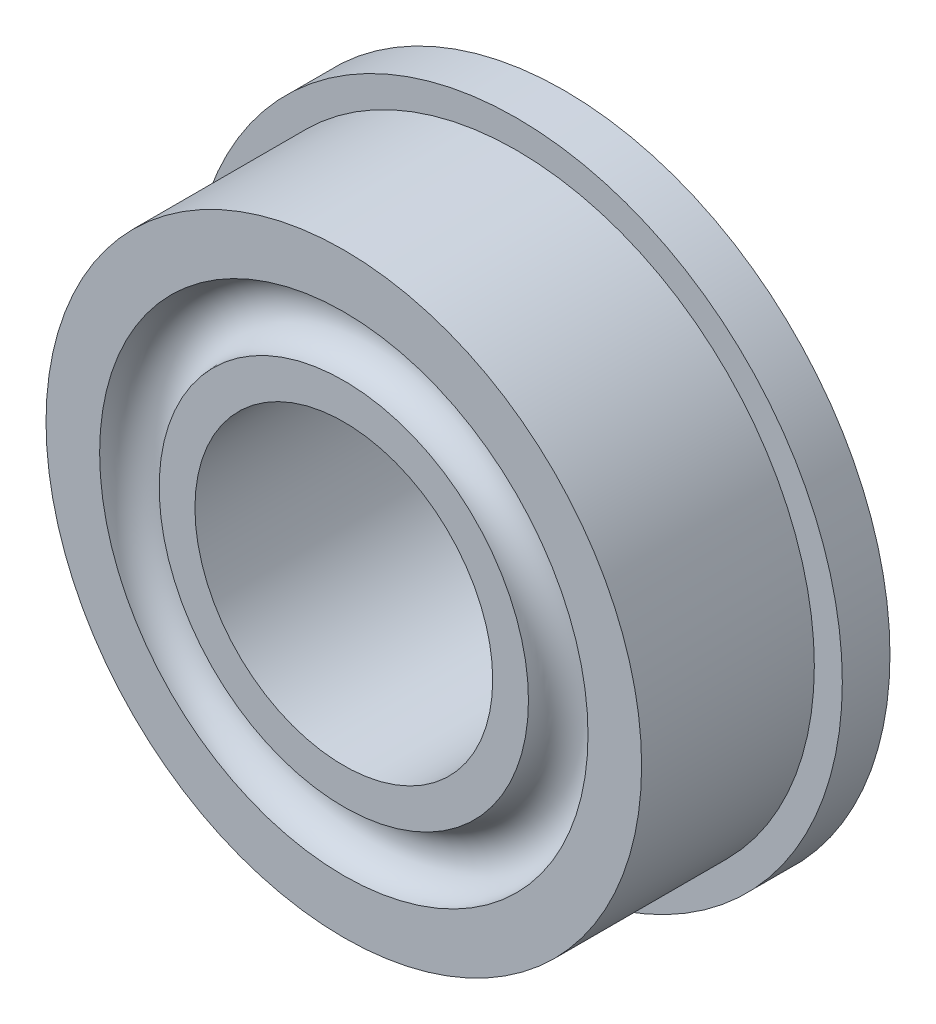
ISO-10303-21;
HEADER;
FILE_DESCRIPTION(('STEP AP214'),'2;1');
FILE_NAME('part.step','',(''),(''),'','','');
FILE_SCHEMA(('AUTOMOTIVE_DESIGN { 1 0 10303 214 1 1 1 1 }'));
ENDSEC;
DATA;
#1=APPLICATION_CONTEXT('core data for automotive mechanical design processes');
#2=APPLICATION_PROTOCOL_DEFINITION('international standard','automotive_design',2000,#1);
#3=PRODUCT_CONTEXT('',#1,'mechanical');
#4=PRODUCT('Part','Part','',(#3));
#5=PRODUCT_RELATED_PRODUCT_CATEGORY('part','',(#4));
#6=PRODUCT_DEFINITION_FORMATION('','',#4);
#7=PRODUCT_DEFINITION_CONTEXT('part definition',#1,'design');
#8=PRODUCT_DEFINITION('design','',#6,#7);
#9=PRODUCT_DEFINITION_SHAPE('','',#8);
#10=(LENGTH_UNIT() NAMED_UNIT(*) SI_UNIT(.MILLI.,.METRE.));
#11=(NAMED_UNIT(*) PLANE_ANGLE_UNIT() SI_UNIT($,.RADIAN.));
#12=(NAMED_UNIT(*) SI_UNIT($,.STERADIAN.) SOLID_ANGLE_UNIT());
#13=UNCERTAINTY_MEASURE_WITH_UNIT(LENGTH_MEASURE(1.E-05),#10,'distance_accuracy_value','');
#14=(GEOMETRIC_REPRESENTATION_CONTEXT(3) GLOBAL_UNCERTAINTY_ASSIGNED_CONTEXT((#13)) GLOBAL_UNIT_ASSIGNED_CONTEXT((#10,
#11,#12)) REPRESENTATION_CONTEXT('',''));
#15=CARTESIAN_POINT('',(0.,0.,0.));
#16=DIRECTION('',(0.,0.,1.));
#17=DIRECTION('',(1.,0.,0.));
#18=AXIS2_PLACEMENT_3D('',#15,#16,#17);
#19=CARTESIAN_POINT('',(0.,0.,0.));
#20=DIRECTION('',(0.,0.,1.));
#21=DIRECTION('',(1.,0.,0.));
#22=AXIS2_PLACEMENT_3D('',#19,#20,#21);
#23=PLANE('',#22);
#24=CARTESIAN_POINT('',(0.,0.,0.));
#25=DIRECTION('',(0.,0.,1.));
#26=DIRECTION('',(1.,0.,0.));
#27=AXIS2_PLACEMENT_3D('',#24,#25,#26);
#28=CIRCLE('',#27,6.9469);
#29=CARTESIAN_POINT('',(6.9469,0.,0.));
#30=VERTEX_POINT('',#29);
#31=EDGE_CURVE('E36',#30,#30,#28,.T.);
#32=ORIENTED_EDGE('',*,*,#31,.F.);
#33=EDGE_LOOP('',(#32));
#34=FACE_BOUND('',#33,.T.);
#35=CARTESIAN_POINT('',(0.,0.,0.));
#36=DIRECTION('',(0.,0.,1.));
#37=DIRECTION('',(1.,0.,0.));
#38=AXIS2_PLACEMENT_3D('',#35,#36,#37);
#39=CIRCLE('',#38,5.207);
#40=CARTESIAN_POINT('',(5.207,0.,0.));
#41=VERTEX_POINT('',#40);
#42=EDGE_CURVE('E69',#41,#41,#39,.T.);
#43=ORIENTED_EDGE('',*,*,#42,.T.);
#44=EDGE_LOOP('',(#43));
#45=FACE_BOUND('',#44,.T.);
#46=ADVANCED_FACE('F32',(#34,#45),#23,.F.);
#47=CARTESIAN_POINT('',(0.,0.,0.));
#48=DIRECTION('',(0.,0.,1.));
#49=DIRECTION('',(1.,0.,0.));
#50=AXIS2_PLACEMENT_3D('',#47,#48,#49);
#51=CIRCLE('',#50,3.175);
#52=CARTESIAN_POINT('',(3.175,0.,0.));
#53=VERTEX_POINT('',#52);
#54=EDGE_CURVE('E43',#53,#53,#51,.T.);
#55=ORIENTED_EDGE('',*,*,#54,.T.);
#56=EDGE_LOOP('',(#55));
#57=FACE_BOUND('',#56,.T.);
#58=CARTESIAN_POINT('',(0.,0.,0.));
#59=DIRECTION('',(0.,0.,1.));
#60=DIRECTION('',(1.,0.,0.));
#61=AXIS2_PLACEMENT_3D('',#58,#59,#60);
#62=CIRCLE('',#61,3.937);
#63=CARTESIAN_POINT('',(3.937,0.,0.));
#64=VERTEX_POINT('',#63);
#65=EDGE_CURVE('E65',#64,#64,#62,.T.);
#66=ORIENTED_EDGE('',*,*,#65,.F.);
#67=EDGE_LOOP('',(#66));
#68=FACE_BOUND('',#67,.T.);
#69=ADVANCED_FACE('F86',(#57,#68),#23,.F.);
#70=CARTESIAN_POINT('',(0.,0.,4.699));
#71=DIRECTION('',(0.,0.,1.));
#72=DIRECTION('',(1.,0.,0.));
#73=AXIS2_PLACEMENT_3D('',#70,#71,#72);
#74=PLANE('',#73);
#75=CARTESIAN_POINT('',(0.,0.,4.699));
#76=DIRECTION('',(0.,0.,1.));
#77=DIRECTION('',(1.,0.,0.));
#78=AXIS2_PLACEMENT_3D('',#75,#76,#77);
#79=CIRCLE('',#78,6.35);
#80=CARTESIAN_POINT('',(6.35,0.,4.699));
#81=VERTEX_POINT('',#80);
#82=EDGE_CURVE('E48',#81,#81,#79,.T.);
#83=ORIENTED_EDGE('',*,*,#82,.T.);
#84=EDGE_LOOP('',(#83));
#85=FACE_BOUND('',#84,.T.);
#86=CARTESIAN_POINT('',(0.,0.,4.699));
#87=DIRECTION('',(0.,0.,1.));
#88=DIRECTION('',(1.,0.,0.));
#89=AXIS2_PLACEMENT_3D('',#86,#87,#88);
#90=CIRCLE('',#89,5.207);
#91=CARTESIAN_POINT('',(5.207,0.,4.699));
#92=VERTEX_POINT('',#91);
#93=EDGE_CURVE('E62',#92,#92,#90,.T.);
#94=ORIENTED_EDGE('',*,*,#93,.F.);
#95=EDGE_LOOP('',(#94));
#96=FACE_BOUND('',#95,.T.);
#97=ADVANCED_FACE('F91',(#85,#96),#74,.T.);
#98=CARTESIAN_POINT('',(0.,0.,4.699));
#99=DIRECTION('',(0.,0.,1.));
#100=DIRECTION('',(1.,0.,0.));
#101=AXIS2_PLACEMENT_3D('',#98,#99,#100);
#102=CIRCLE('',#101,3.175);
#103=CARTESIAN_POINT('',(3.175,0.,4.699));
#104=VERTEX_POINT('',#103);
#105=EDGE_CURVE('E52',#104,#104,#102,.T.);
#106=ORIENTED_EDGE('',*,*,#105,.F.);
#107=EDGE_LOOP('',(#106));
#108=FACE_BOUND('',#107,.T.);
#109=CARTESIAN_POINT('',(0.,0.,4.699));
#110=DIRECTION('',(0.,0.,1.));
#111=DIRECTION('',(1.,0.,0.));
#112=AXIS2_PLACEMENT_3D('',#109,#110,#111);
#113=CIRCLE('',#112,3.937);
#114=CARTESIAN_POINT('',(3.937,0.,4.699));
#115=VERTEX_POINT('',#114);
#116=EDGE_CURVE('E58',#115,#115,#113,.T.);
#117=ORIENTED_EDGE('',*,*,#116,.T.);
#118=EDGE_LOOP('',(#117));
#119=FACE_BOUND('',#118,.T.);
#120=ADVANCED_FACE('F98',(#108,#119),#74,.T.);
#121=CARTESIAN_POINT('',(0.,0.,1.016));
#122=DIRECTION('',(0.,0.,1.));
#123=DIRECTION('',(1.,0.,0.));
#124=AXIS2_PLACEMENT_3D('',#121,#122,#123);
#125=PLANE('',#124);
#126=CARTESIAN_POINT('',(0.,0.,1.016));
#127=DIRECTION('',(0.,0.,1.));
#128=DIRECTION('',(1.,0.,0.));
#129=AXIS2_PLACEMENT_3D('',#126,#127,#128);
#130=CIRCLE('',#129,6.9469);
#131=CARTESIAN_POINT('',(6.9469,0.,1.016));
#132=VERTEX_POINT('',#131);
#133=EDGE_CURVE('E10',#132,#132,#130,.T.);
#134=ORIENTED_EDGE('',*,*,#133,.T.);
#135=EDGE_LOOP('',(#134));
#136=FACE_BOUND('',#135,.T.);
#137=CARTESIAN_POINT('',(0.,0.,1.016));
#138=DIRECTION('',(0.,0.,1.));
#139=DIRECTION('',(1.,0.,0.));
#140=AXIS2_PLACEMENT_3D('',#137,#138,#139);
#141=CIRCLE('',#140,6.35);
#142=CARTESIAN_POINT('',(6.35,0.,1.016));
#143=VERTEX_POINT('',#142);
#144=EDGE_CURVE('E49',#143,#143,#141,.T.);
#145=ORIENTED_EDGE('',*,*,#144,.F.);
#146=EDGE_LOOP('',(#145));
#147=FACE_BOUND('',#146,.T.);
#148=ADVANCED_FACE('F95',(#136,#147),#125,.T.);
#149=CARTESIAN_POINT('',(0.,0.,1.016));
#150=DIRECTION('',(0.,0.,-1.));
#151=DIRECTION('',(-1.,0.,0.));
#152=AXIS2_PLACEMENT_3D('',#149,#150,#151);
#153=CYLINDRICAL_SURFACE('',#152,6.9469);
#154=ORIENTED_EDGE('',*,*,#133,.F.);
#155=EDGE_LOOP('',(#154));
#156=FACE_BOUND('',#155,.T.);
#157=ORIENTED_EDGE('',*,*,#31,.T.);
#158=EDGE_LOOP('',(#157));
#159=FACE_BOUND('',#158,.T.);
#160=ADVANCED_FACE('F34',(#156,#159),#153,.T.);
#161=CARTESIAN_POINT('',(0.,0.,1.016));
#162=DIRECTION('',(0.,0.,-1.));
#163=DIRECTION('',(-1.,0.,0.));
#164=AXIS2_PLACEMENT_3D('',#161,#162,#163);
#165=CYLINDRICAL_SURFACE('',#164,3.175);
#166=ORIENTED_EDGE('',*,*,#54,.F.);
#167=EDGE_LOOP('',(#166));
#168=FACE_BOUND('',#167,.T.);
#169=ORIENTED_EDGE('',*,*,#105,.T.);
#170=EDGE_LOOP('',(#169));
#171=FACE_BOUND('',#170,.T.);
#172=ADVANCED_FACE('F99',(#168,#171),#165,.F.);
#173=CARTESIAN_POINT('',(0.,0.,4.699));
#174=DIRECTION('',(0.,0.,-1.));
#175=DIRECTION('',(-1.,0.,0.));
#176=AXIS2_PLACEMENT_3D('',#173,#174,#175);
#177=CYLINDRICAL_SURFACE('',#176,6.35);
#178=ORIENTED_EDGE('',*,*,#82,.F.);
#179=EDGE_LOOP('',(#178));
#180=FACE_BOUND('',#179,.T.);
#181=ORIENTED_EDGE('',*,*,#144,.T.);
#182=EDGE_LOOP('',(#181));
#183=FACE_BOUND('',#182,.T.);
#184=ADVANCED_FACE('F82',(#180,#183),#177,.T.);
#185=CARTESIAN_POINT('',(0.,0.,4.699));
#186=DIRECTION('',(0.,0.,1.));
#187=DIRECTION('',(1.,0.,0.));
#188=AXIS2_PLACEMENT_3D('',#185,#186,#187);
#189=TOROIDAL_SURFACE('',#188,4.572,0.635);
#190=ORIENTED_EDGE('',*,*,#93,.T.);
#191=EDGE_LOOP('',(#190));
#192=FACE_BOUND('',#191,.T.);
#193=ORIENTED_EDGE('',*,*,#116,.F.);
#194=EDGE_LOOP('',(#193));
#195=FACE_BOUND('',#194,.T.);
#196=ADVANCED_FACE('F76',(#192,#195),#189,.F.);
#197=CARTESIAN_POINT('',(0.,0.,0.));
#198=DIRECTION('',(0.,0.,1.));
#199=DIRECTION('',(1.,0.,0.));
#200=AXIS2_PLACEMENT_3D('',#197,#198,#199);
#201=TOROIDAL_SURFACE('',#200,4.572,0.635);
#202=ORIENTED_EDGE('',*,*,#65,.T.);
#203=EDGE_LOOP('',(#202));
#204=FACE_BOUND('',#203,.T.);
#205=ORIENTED_EDGE('',*,*,#42,.F.);
#206=EDGE_LOOP('',(#205));
#207=FACE_BOUND('',#206,.T.);
#208=ADVANCED_FACE('F74',(#204,#207),#201,.F.);
#209=CLOSED_SHELL('',(#46,#69,#97,#120,#148,#160,#172,#184,#196,#208));
#210=MANIFOLD_SOLID_BREP('B2',#209);
#211=ADVANCED_BREP_SHAPE_REPRESENTATION('',(#18,#210),#14);
#212=SHAPE_DEFINITION_REPRESENTATION(#9,#211);
ENDSEC;
END-ISO-10303-21;
